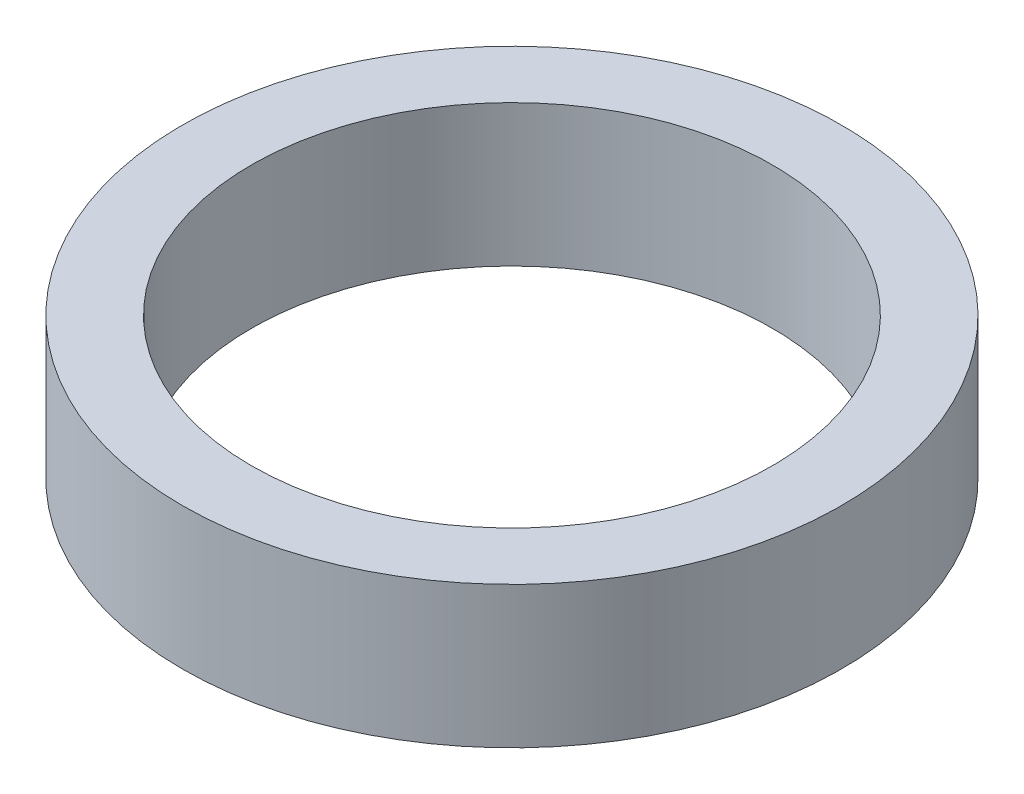
ISO-10303-21;
HEADER;
FILE_DESCRIPTION(('STEP AP214'),'2;1');
FILE_NAME('part.step','',(''),(''),'','','');
FILE_SCHEMA(('AUTOMOTIVE_DESIGN { 1 0 10303 214 1 1 1 1 }'));
ENDSEC;
DATA;
#1=APPLICATION_CONTEXT('core data for automotive mechanical design processes');
#2=APPLICATION_PROTOCOL_DEFINITION('international standard','automotive_design',2000,#1);
#3=PRODUCT_CONTEXT('',#1,'mechanical');
#4=PRODUCT('Part','Part','',(#3));
#5=PRODUCT_RELATED_PRODUCT_CATEGORY('part','',(#4));
#6=PRODUCT_DEFINITION_FORMATION('','',#4);
#7=PRODUCT_DEFINITION_CONTEXT('part definition',#1,'design');
#8=PRODUCT_DEFINITION('design','',#6,#7);
#9=PRODUCT_DEFINITION_SHAPE('','',#8);
#10=(LENGTH_UNIT() NAMED_UNIT(*) SI_UNIT(.MILLI.,.METRE.));
#11=(NAMED_UNIT(*) PLANE_ANGLE_UNIT() SI_UNIT($,.RADIAN.));
#12=(NAMED_UNIT(*) SI_UNIT($,.STERADIAN.) SOLID_ANGLE_UNIT());
#13=UNCERTAINTY_MEASURE_WITH_UNIT(LENGTH_MEASURE(1.E-05),#10,'distance_accuracy_value','');
#14=(GEOMETRIC_REPRESENTATION_CONTEXT(3) GLOBAL_UNCERTAINTY_ASSIGNED_CONTEXT((#13)) GLOBAL_UNIT_ASSIGNED_CONTEXT((#10,
#11,#12)) REPRESENTATION_CONTEXT('',''));
#15=CARTESIAN_POINT('',(0.,0.,0.));
#16=DIRECTION('',(0.,0.,1.));
#17=DIRECTION('',(1.,0.,0.));
#18=AXIS2_PLACEMENT_3D('',#15,#16,#17);
#19=CARTESIAN_POINT('',(0.,21.4064915110438,0.));
#20=DIRECTION('',(0.,1.,0.));
#21=DIRECTION('',(0.,0.,1.));
#22=AXIS2_PLACEMENT_3D('',#19,#20,#21);
#23=CYLINDRICAL_SURFACE('',#22,34.2179580744912);
#24=CARTESIAN_POINT('',(0.,-7.34832023687394,0.));
#25=DIRECTION('',(0.,1.,0.));
#26=DIRECTION('',(0.,0.,1.));
#27=AXIS2_PLACEMENT_3D('',#24,#25,#26);
#28=CIRCLE('',#27,34.2179580744912);
#29=CARTESIAN_POINT('',(0.,-7.34832023687394,34.2179580744912));
#30=VERTEX_POINT('',#29);
#31=EDGE_CURVE('E10',#30,#30,#28,.T.);
#32=ORIENTED_EDGE('',*,*,#31,.T.);
#33=EDGE_LOOP('',(#32));
#34=FACE_BOUND('',#33,.T.);
#35=CARTESIAN_POINT('',(0.,7.34832023687394,0.));
#36=DIRECTION('',(0.,1.,0.));
#37=DIRECTION('',(0.,0.,1.));
#38=AXIS2_PLACEMENT_3D('',#35,#36,#37);
#39=CIRCLE('',#38,34.2179580744912);
#40=CARTESIAN_POINT('',(0.,7.34832023687394,34.2179580744912));
#41=VERTEX_POINT('',#40);
#42=EDGE_CURVE('E48',#41,#41,#39,.T.);
#43=ORIENTED_EDGE('',*,*,#42,.F.);
#44=EDGE_LOOP('',(#43));
#45=FACE_BOUND('',#44,.T.);
#46=ADVANCED_FACE('F34',(#34,#45),#23,.T.);
#47=CARTESIAN_POINT('',(-27.0512417479194,-7.34832023687394,0.));
#48=DIRECTION('',(0.,-1.,0.));
#49=DIRECTION('',(0.,0.,-1.));
#50=AXIS2_PLACEMENT_3D('',#47,#48,#49);
#51=PLANE('',#50);
#52=CARTESIAN_POINT('',(0.,-7.34832023687394,0.));
#53=DIRECTION('',(0.,1.,0.));
#54=DIRECTION('',(0.,0.,1.));
#55=AXIS2_PLACEMENT_3D('',#52,#53,#54);
#56=CIRCLE('',#55,27.0512417479194);
#57=CARTESIAN_POINT('',(0.,-7.34832023687394,27.0512417479194));
#58=VERTEX_POINT('',#57);
#59=EDGE_CURVE('E40',#58,#58,#56,.T.);
#60=ORIENTED_EDGE('',*,*,#59,.T.);
#61=EDGE_LOOP('',(#60));
#62=FACE_BOUND('',#61,.T.);
#63=ORIENTED_EDGE('',*,*,#31,.F.);
#64=EDGE_LOOP('',(#63));
#65=FACE_BOUND('',#64,.T.);
#66=ADVANCED_FACE('F58',(#62,#65),#51,.T.);
#67=CARTESIAN_POINT('',(0.,21.4064915110438,0.));
#68=DIRECTION('',(0.,1.,0.));
#69=DIRECTION('',(0.,0.,1.));
#70=AXIS2_PLACEMENT_3D('',#67,#68,#69);
#71=CYLINDRICAL_SURFACE('',#70,27.0512417479194);
#72=CARTESIAN_POINT('',(0.,7.34832023687394,0.));
#73=DIRECTION('',(0.,1.,0.));
#74=DIRECTION('',(0.,0.,1.));
#75=AXIS2_PLACEMENT_3D('',#72,#73,#74);
#76=CIRCLE('',#75,27.0512417479194);
#77=CARTESIAN_POINT('',(0.,7.34832023687394,27.0512417479194));
#78=VERTEX_POINT('',#77);
#79=EDGE_CURVE('E44',#78,#78,#76,.T.);
#80=ORIENTED_EDGE('',*,*,#79,.T.);
#81=EDGE_LOOP('',(#80));
#82=FACE_BOUND('',#81,.T.);
#83=ORIENTED_EDGE('',*,*,#59,.F.);
#84=EDGE_LOOP('',(#83));
#85=FACE_BOUND('',#84,.T.);
#86=ADVANCED_FACE('F62',(#82,#85),#71,.F.);
#87=CARTESIAN_POINT('',(-27.0512417479194,7.34832023687394,0.));
#88=DIRECTION('',(0.,1.,0.));
#89=DIRECTION('',(0.,0.,1.));
#90=AXIS2_PLACEMENT_3D('',#87,#88,#89);
#91=PLANE('',#90);
#92=ORIENTED_EDGE('',*,*,#42,.T.);
#93=EDGE_LOOP('',(#92));
#94=FACE_BOUND('',#93,.T.);
#95=ORIENTED_EDGE('',*,*,#79,.F.);
#96=EDGE_LOOP('',(#95));
#97=FACE_BOUND('',#96,.T.);
#98=ADVANCED_FACE('F54',(#94,#97),#91,.T.);
#99=CLOSED_SHELL('',(#46,#66,#86,#98));
#100=MANIFOLD_SOLID_BREP('B2',#99);
#101=ADVANCED_BREP_SHAPE_REPRESENTATION('',(#18,#100),#14);
#102=SHAPE_DEFINITION_REPRESENTATION(#9,#101);
ENDSEC;
END-ISO-10303-21;
